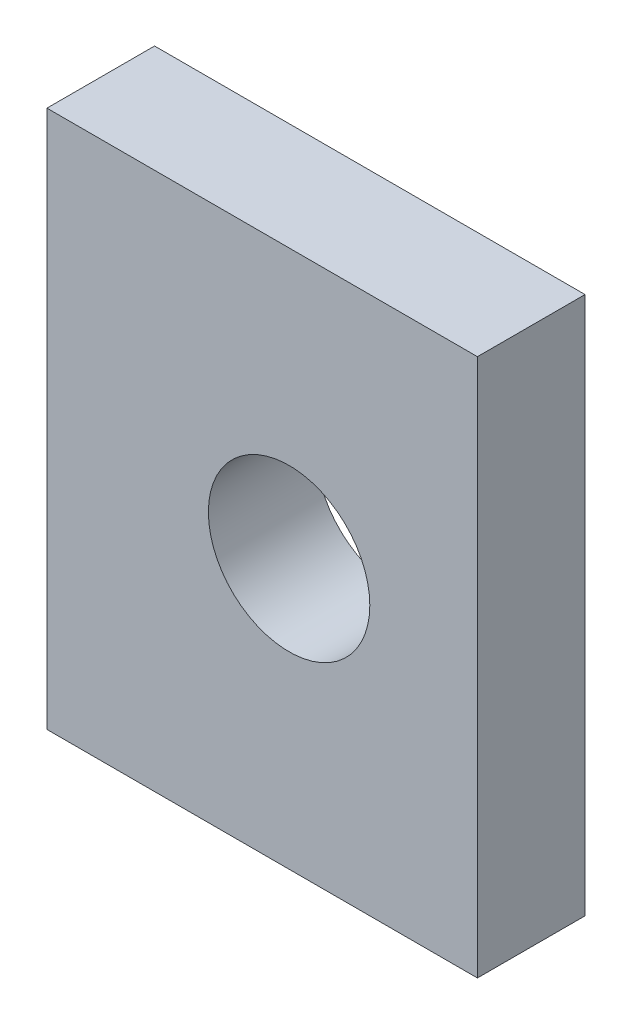
ISO-10303-21;
HEADER;
FILE_DESCRIPTION(('STEP AP214'),'2;1');
FILE_NAME('part.step','',(''),(''),'','','');
FILE_SCHEMA(('AUTOMOTIVE_DESIGN { 1 0 10303 214 1 1 1 1 }'));
ENDSEC;
DATA;
#1=APPLICATION_CONTEXT('core data for automotive mechanical design processes');
#2=APPLICATION_PROTOCOL_DEFINITION('international standard','automotive_design',2000,#1);
#3=PRODUCT_CONTEXT('',#1,'mechanical');
#4=PRODUCT('Part','Part','',(#3));
#5=PRODUCT_RELATED_PRODUCT_CATEGORY('part','',(#4));
#6=PRODUCT_DEFINITION_FORMATION('','',#4);
#7=PRODUCT_DEFINITION_CONTEXT('part definition',#1,'design');
#8=PRODUCT_DEFINITION('design','',#6,#7);
#9=PRODUCT_DEFINITION_SHAPE('','',#8);
#10=(LENGTH_UNIT() NAMED_UNIT(*) SI_UNIT(.MILLI.,.METRE.));
#11=(NAMED_UNIT(*) PLANE_ANGLE_UNIT() SI_UNIT($,.RADIAN.));
#12=(NAMED_UNIT(*) SI_UNIT($,.STERADIAN.) SOLID_ANGLE_UNIT());
#13=UNCERTAINTY_MEASURE_WITH_UNIT(LENGTH_MEASURE(1.E-05),#10,'distance_accuracy_value','');
#14=(GEOMETRIC_REPRESENTATION_CONTEXT(3) GLOBAL_UNCERTAINTY_ASSIGNED_CONTEXT((#13)) GLOBAL_UNIT_ASSIGNED_CONTEXT((#10,
#11,#12)) REPRESENTATION_CONTEXT('',''));
#15=CARTESIAN_POINT('',(0.,0.,0.));
#16=DIRECTION('',(0.,0.,1.));
#17=DIRECTION('',(1.,0.,0.));
#18=AXIS2_PLACEMENT_3D('',#15,#16,#17);
#19=CARTESIAN_POINT('',(0.,0.,2.));
#20=DIRECTION('',(0.,0.,-1.));
#21=DIRECTION('',(-1.,0.,0.));
#22=AXIS2_PLACEMENT_3D('',#19,#20,#21);
#23=PLANE('',#22);
#24=DIRECTION('',(0.,1.,0.));
#25=VECTOR('',#24,1.);
#26=CARTESIAN_POINT('',(7.99999999999996,10.,2.));
#27=LINE('',#26,#25);
#28=CARTESIAN_POINT('',(7.99999999999996,0.,2.));
#29=VERTEX_POINT('',#28);
#30=CARTESIAN_POINT('',(7.99999999999996,10.,2.));
#31=VERTEX_POINT('',#30);
#32=EDGE_CURVE('E84',#29,#31,#27,.T.);
#33=ORIENTED_EDGE('',*,*,#32,.T.);
#34=DIRECTION('',(-1.,0.,0.));
#35=VECTOR('',#34,1.);
#36=CARTESIAN_POINT('',(0.,10.,2.));
#37=LINE('',#36,#35);
#38=CARTESIAN_POINT('',(0.,10.,2.));
#39=VERTEX_POINT('',#38);
#40=EDGE_CURVE('E79',#31,#39,#37,.T.);
#41=ORIENTED_EDGE('',*,*,#40,.T.);
#42=DIRECTION('',(0.,-1.,0.));
#43=VECTOR('',#42,1.);
#44=CARTESIAN_POINT('',(0.,10.,2.));
#45=LINE('',#44,#43);
#46=CARTESIAN_POINT('',(0.,0.,2.));
#47=VERTEX_POINT('',#46);
#48=EDGE_CURVE('E82',#39,#47,#45,.T.);
#49=ORIENTED_EDGE('',*,*,#48,.T.);
#50=DIRECTION('',(1.,0.,0.));
#51=VECTOR('',#50,1.);
#52=CARTESIAN_POINT('',(7.99999999999996,0.,2.));
#53=LINE('',#52,#51);
#54=EDGE_CURVE('E49',#47,#29,#53,.T.);
#55=ORIENTED_EDGE('',*,*,#54,.T.);
#56=EDGE_LOOP('',(#33,#41,#49,#55));
#57=FACE_BOUND('',#56,.T.);
#58=CARTESIAN_POINT('',(4.49999999999998,5.,2.));
#59=DIRECTION('',(0.,0.,1.));
#60=DIRECTION('',(1.,0.,0.));
#61=AXIS2_PLACEMENT_3D('',#58,#59,#60);
#62=CIRCLE('',#61,1.5);
#63=CARTESIAN_POINT('',(5.99999999999998,5.,2.));
#64=VERTEX_POINT('',#63);
#65=EDGE_CURVE('E99',#64,#64,#62,.T.);
#66=ORIENTED_EDGE('',*,*,#65,.F.);
#67=EDGE_LOOP('',(#66));
#68=FACE_BOUND('',#67,.T.);
#69=ADVANCED_FACE('F32',(#57,#68),#23,.F.);
#70=CARTESIAN_POINT('',(0.,0.,0.));
#71=DIRECTION('',(0.,0.,-1.));
#72=DIRECTION('',(-1.,0.,0.));
#73=AXIS2_PLACEMENT_3D('',#70,#71,#72);
#74=PLANE('',#73);
#75=DIRECTION('',(0.,1.,0.));
#76=VECTOR('',#75,1.);
#77=CARTESIAN_POINT('',(7.99999999999996,10.,0.));
#78=LINE('',#77,#76);
#79=CARTESIAN_POINT('',(7.99999999999996,0.,0.));
#80=VERTEX_POINT('',#79);
#81=CARTESIAN_POINT('',(7.99999999999996,10.,0.));
#82=VERTEX_POINT('',#81);
#83=EDGE_CURVE('E96',#80,#82,#78,.T.);
#84=ORIENTED_EDGE('',*,*,#83,.F.);
#85=DIRECTION('',(1.,0.,0.));
#86=VECTOR('',#85,1.);
#87=CARTESIAN_POINT('',(7.99999999999996,0.,0.));
#88=LINE('',#87,#86);
#89=CARTESIAN_POINT('',(0.,0.,0.));
#90=VERTEX_POINT('',#89);
#91=EDGE_CURVE('E72',#90,#80,#88,.T.);
#92=ORIENTED_EDGE('',*,*,#91,.F.);
#93=DIRECTION('',(0.,-1.,0.));
#94=VECTOR('',#93,1.);
#95=CARTESIAN_POINT('',(0.,10.,0.));
#96=LINE('',#95,#94);
#97=CARTESIAN_POINT('',(0.,10.,0.));
#98=VERTEX_POINT('',#97);
#99=EDGE_CURVE('E66',#98,#90,#96,.T.);
#100=ORIENTED_EDGE('',*,*,#99,.F.);
#101=DIRECTION('',(-1.,0.,0.));
#102=VECTOR('',#101,1.);
#103=CARTESIAN_POINT('',(0.,10.,0.));
#104=LINE('',#103,#102);
#105=EDGE_CURVE('E88',#82,#98,#104,.T.);
#106=ORIENTED_EDGE('',*,*,#105,.F.);
#107=EDGE_LOOP('',(#84,#92,#100,#106));
#108=FACE_BOUND('',#107,.T.);
#109=CARTESIAN_POINT('',(4.49999999999998,5.,0.));
#110=DIRECTION('',(0.,0.,1.));
#111=DIRECTION('',(1.,0.,0.));
#112=AXIS2_PLACEMENT_3D('',#109,#110,#111);
#113=CIRCLE('',#112,1.5);
#114=CARTESIAN_POINT('',(5.99999999999998,5.,0.));
#115=VERTEX_POINT('',#114);
#116=EDGE_CURVE('E111',#115,#115,#113,.T.);
#117=ORIENTED_EDGE('',*,*,#116,.T.);
#118=EDGE_LOOP('',(#117));
#119=FACE_BOUND('',#118,.T.);
#120=ADVANCED_FACE('F107',(#108,#119),#74,.T.);
#121=CARTESIAN_POINT('',(7.99999999999996,10.,2.));
#122=DIRECTION('',(-1.,0.,0.));
#123=DIRECTION('',(0.,0.,1.));
#124=AXIS2_PLACEMENT_3D('',#121,#122,#123);
#125=PLANE('',#124);
#126=ORIENTED_EDGE('',*,*,#83,.T.);
#127=DIRECTION('',(0.,0.,-1.));
#128=VECTOR('',#127,1.);
#129=CARTESIAN_POINT('',(7.99999999999996,10.,2.));
#130=LINE('',#129,#128);
#131=EDGE_CURVE('E11',#31,#82,#130,.T.);
#132=ORIENTED_EDGE('',*,*,#131,.F.);
#133=ORIENTED_EDGE('',*,*,#32,.F.);
#134=DIRECTION('',(0.,0.,-1.));
#135=VECTOR('',#134,1.);
#136=CARTESIAN_POINT('',(7.99999999999996,0.,2.));
#137=LINE('',#136,#135);
#138=EDGE_CURVE('E92',#29,#80,#137,.T.);
#139=ORIENTED_EDGE('',*,*,#138,.T.);
#140=EDGE_LOOP('',(#126,#132,#133,#139));
#141=FACE_BOUND('',#140,.T.);
#142=ADVANCED_FACE('F34',(#141),#125,.F.);
#143=CARTESIAN_POINT('',(0.,10.,2.));
#144=DIRECTION('',(0.,-1.,0.));
#145=DIRECTION('',(1.,0.,0.));
#146=AXIS2_PLACEMENT_3D('',#143,#144,#145);
#147=PLANE('',#146);
#148=ORIENTED_EDGE('',*,*,#105,.T.);
#149=DIRECTION('',(0.,0.,-1.));
#150=VECTOR('',#149,1.);
#151=CARTESIAN_POINT('',(0.,10.,2.));
#152=LINE('',#151,#150);
#153=EDGE_CURVE('E41',#39,#98,#152,.T.);
#154=ORIENTED_EDGE('',*,*,#153,.F.);
#155=ORIENTED_EDGE('',*,*,#40,.F.);
#156=ORIENTED_EDGE('',*,*,#131,.T.);
#157=EDGE_LOOP('',(#148,#154,#155,#156));
#158=FACE_BOUND('',#157,.T.);
#159=ADVANCED_FACE('F87',(#158),#147,.F.);
#160=CARTESIAN_POINT('',(0.,10.,2.));
#161=DIRECTION('',(1.,0.,0.));
#162=DIRECTION('',(0.,1.,0.));
#163=AXIS2_PLACEMENT_3D('',#160,#161,#162);
#164=PLANE('',#163);
#165=ORIENTED_EDGE('',*,*,#99,.T.);
#166=DIRECTION('',(0.,0.,-1.));
#167=VECTOR('',#166,1.);
#168=CARTESIAN_POINT('',(0.,0.,2.));
#169=LINE('',#168,#167);
#170=EDGE_CURVE('E89',#47,#90,#169,.T.);
#171=ORIENTED_EDGE('',*,*,#170,.F.);
#172=ORIENTED_EDGE('',*,*,#48,.F.);
#173=ORIENTED_EDGE('',*,*,#153,.T.);
#174=EDGE_LOOP('',(#165,#171,#172,#173));
#175=FACE_BOUND('',#174,.T.);
#176=ADVANCED_FACE('F90',(#175),#164,.F.);
#177=CARTESIAN_POINT('',(7.99999999999996,0.,2.));
#178=DIRECTION('',(0.,1.,0.));
#179=DIRECTION('',(-1.,0.,0.));
#180=AXIS2_PLACEMENT_3D('',#177,#178,#179);
#181=PLANE('',#180);
#182=ORIENTED_EDGE('',*,*,#91,.T.);
#183=ORIENTED_EDGE('',*,*,#138,.F.);
#184=ORIENTED_EDGE('',*,*,#54,.F.);
#185=ORIENTED_EDGE('',*,*,#170,.T.);
#186=EDGE_LOOP('',(#182,#183,#184,#185));
#187=FACE_BOUND('',#186,.T.);
#188=ADVANCED_FACE('F104',(#187),#181,.F.);
#189=CARTESIAN_POINT('',(4.49999999999998,5.,2.));
#190=DIRECTION('',(0.,0.,-1.));
#191=DIRECTION('',(-1.,0.,0.));
#192=AXIS2_PLACEMENT_3D('',#189,#190,#191);
#193=CYLINDRICAL_SURFACE('',#192,1.5);
#194=ORIENTED_EDGE('',*,*,#65,.T.);
#195=EDGE_LOOP('',(#194));
#196=FACE_BOUND('',#195,.T.);
#197=ORIENTED_EDGE('',*,*,#116,.F.);
#198=EDGE_LOOP('',(#197));
#199=FACE_BOUND('',#198,.T.);
#200=ADVANCED_FACE('F117',(#196,#199),#193,.F.);
#201=CLOSED_SHELL('',(#69,#120,#142,#159,#176,#188,#200));
#202=MANIFOLD_SOLID_BREP('B2',#201);
#203=ADVANCED_BREP_SHAPE_REPRESENTATION('',(#18,#202),#14);
#204=SHAPE_DEFINITION_REPRESENTATION(#9,#203);
ENDSEC;
END-ISO-10303-21;
